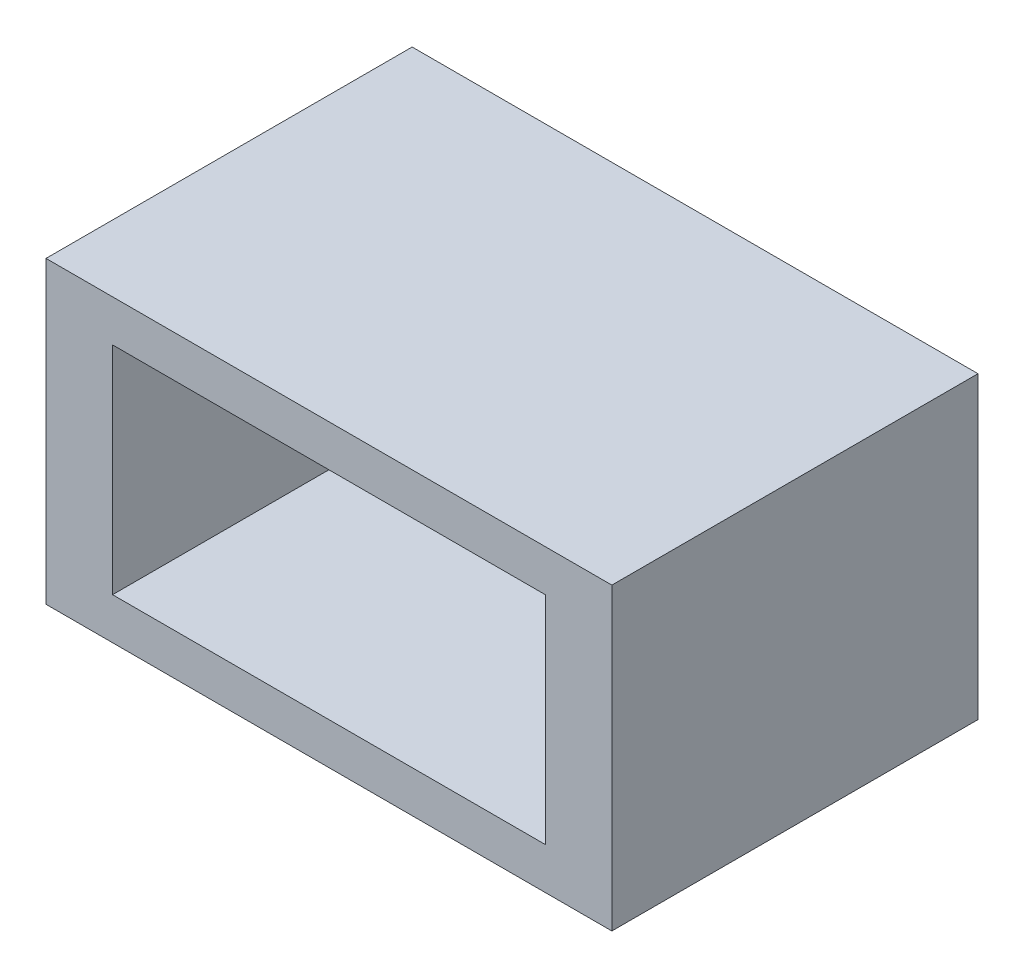
ISO-10303-21;
HEADER;
FILE_DESCRIPTION(('STEP AP214'),'2;1');
FILE_NAME('part.step','',(''),(''),'','','');
FILE_SCHEMA(('AUTOMOTIVE_DESIGN { 1 0 10303 214 1 1 1 1 }'));
ENDSEC;
DATA;
#1=APPLICATION_CONTEXT('core data for automotive mechanical design processes');
#2=APPLICATION_PROTOCOL_DEFINITION('international standard','automotive_design',2000,#1);
#3=PRODUCT_CONTEXT('',#1,'mechanical');
#4=PRODUCT('Part','Part','',(#3));
#5=PRODUCT_RELATED_PRODUCT_CATEGORY('part','',(#4));
#6=PRODUCT_DEFINITION_FORMATION('','',#4);
#7=PRODUCT_DEFINITION_CONTEXT('part definition',#1,'design');
#8=PRODUCT_DEFINITION('design','',#6,#7);
#9=PRODUCT_DEFINITION_SHAPE('','',#8);
#10=(LENGTH_UNIT() NAMED_UNIT(*) SI_UNIT(.MILLI.,.METRE.));
#11=(NAMED_UNIT(*) PLANE_ANGLE_UNIT() SI_UNIT($,.RADIAN.));
#12=(NAMED_UNIT(*) SI_UNIT($,.STERADIAN.) SOLID_ANGLE_UNIT());
#13=UNCERTAINTY_MEASURE_WITH_UNIT(LENGTH_MEASURE(1.E-05),#10,'distance_accuracy_value','');
#14=(GEOMETRIC_REPRESENTATION_CONTEXT(3) GLOBAL_UNCERTAINTY_ASSIGNED_CONTEXT((#13)) GLOBAL_UNIT_ASSIGNED_CONTEXT((#10,
#11,#12)) REPRESENTATION_CONTEXT('',''));
#15=CARTESIAN_POINT('',(0.,0.,0.));
#16=DIRECTION('',(0.,0.,1.));
#17=DIRECTION('',(1.,0.,0.));
#18=AXIS2_PLACEMENT_3D('',#15,#16,#17);
#19=CARTESIAN_POINT('',(8.5,4.5,11.));
#20=DIRECTION('',(-1.,0.,0.));
#21=DIRECTION('',(0.,-1.,0.));
#22=AXIS2_PLACEMENT_3D('',#19,#20,#21);
#23=PLANE('',#22);
#24=DIRECTION('',(0.,1.,0.));
#25=VECTOR('',#24,1.);
#26=CARTESIAN_POINT('',(8.5,4.5,0.));
#27=LINE('',#26,#25);
#28=CARTESIAN_POINT('',(8.50000000000001,-4.5,0.));
#29=VERTEX_POINT('',#28);
#30=CARTESIAN_POINT('',(8.5,4.5,0.));
#31=VERTEX_POINT('',#30);
#32=EDGE_CURVE('E127',#29,#31,#27,.T.);
#33=ORIENTED_EDGE('',*,*,#32,.T.);
#34=DIRECTION('',(0.,0.,-1.));
#35=VECTOR('',#34,1.);
#36=CARTESIAN_POINT('',(8.5,4.5,11.));
#37=LINE('',#36,#35);
#38=CARTESIAN_POINT('',(8.5,4.5,11.));
#39=VERTEX_POINT('',#38);
#40=EDGE_CURVE('E11',#39,#31,#37,.T.);
#41=ORIENTED_EDGE('',*,*,#40,.F.);
#42=DIRECTION('',(0.,1.,0.));
#43=VECTOR('',#42,1.);
#44=CARTESIAN_POINT('',(8.5,4.5,11.));
#45=LINE('',#44,#43);
#46=CARTESIAN_POINT('',(8.50000000000001,-4.5,11.));
#47=VERTEX_POINT('',#46);
#48=EDGE_CURVE('E129',#47,#39,#45,.T.);
#49=ORIENTED_EDGE('',*,*,#48,.F.);
#50=DIRECTION('',(0.,0.,-1.));
#51=VECTOR('',#50,1.);
#52=CARTESIAN_POINT('',(8.50000000000001,-4.5,11.));
#53=LINE('',#52,#51);
#54=EDGE_CURVE('E139',#47,#29,#53,.T.);
#55=ORIENTED_EDGE('',*,*,#54,.T.);
#56=EDGE_LOOP('',(#33,#41,#49,#55));
#57=FACE_BOUND('',#56,.T.);
#58=ADVANCED_FACE('F33',(#57),#23,.F.);
#59=CARTESIAN_POINT('',(-8.5,4.5,11.));
#60=DIRECTION('',(0.,-1.,0.));
#61=DIRECTION('',(0.,0.,-1.));
#62=AXIS2_PLACEMENT_3D('',#59,#60,#61);
#63=PLANE('',#62);
#64=DIRECTION('',(-1.,0.,0.));
#65=VECTOR('',#64,1.);
#66=CARTESIAN_POINT('',(-8.5,4.5,0.));
#67=LINE('',#66,#65);
#68=CARTESIAN_POINT('',(-8.5,4.5,0.));
#69=VERTEX_POINT('',#68);
#70=EDGE_CURVE('E142',#31,#69,#67,.T.);
#71=ORIENTED_EDGE('',*,*,#70,.T.);
#72=DIRECTION('',(0.,0.,-1.));
#73=VECTOR('',#72,1.);
#74=CARTESIAN_POINT('',(-8.5,4.5,11.));
#75=LINE('',#74,#73);
#76=CARTESIAN_POINT('',(-8.5,4.5,11.));
#77=VERTEX_POINT('',#76);
#78=EDGE_CURVE('E40',#77,#69,#75,.T.);
#79=ORIENTED_EDGE('',*,*,#78,.F.);
#80=DIRECTION('',(-1.,0.,0.));
#81=VECTOR('',#80,1.);
#82=CARTESIAN_POINT('',(-8.5,4.5,11.));
#83=LINE('',#82,#81);
#84=EDGE_CURVE('E132',#39,#77,#83,.T.);
#85=ORIENTED_EDGE('',*,*,#84,.F.);
#86=ORIENTED_EDGE('',*,*,#40,.T.);
#87=EDGE_LOOP('',(#71,#79,#85,#86));
#88=FACE_BOUND('',#87,.T.);
#89=ADVANCED_FACE('F170',(#88),#63,.F.);
#90=CARTESIAN_POINT('',(-8.5,4.5,11.));
#91=DIRECTION('',(1.,0.,0.));
#92=DIRECTION('',(0.,1.,0.));
#93=AXIS2_PLACEMENT_3D('',#90,#91,#92);
#94=PLANE('',#93);
#95=DIRECTION('',(0.,-1.,0.));
#96=VECTOR('',#95,1.);
#97=CARTESIAN_POINT('',(-8.5,4.5,0.));
#98=LINE('',#97,#96);
#99=CARTESIAN_POINT('',(-8.49999999999999,-4.5,0.));
#100=VERTEX_POINT('',#99);
#101=EDGE_CURVE('E144',#69,#100,#98,.T.);
#102=ORIENTED_EDGE('',*,*,#101,.T.);
#103=DIRECTION('',(0.,0.,-1.));
#104=VECTOR('',#103,1.);
#105=CARTESIAN_POINT('',(-8.49999999999999,-4.5,11.));
#106=LINE('',#105,#104);
#107=CARTESIAN_POINT('',(-8.49999999999999,-4.5,11.));
#108=VERTEX_POINT('',#107);
#109=EDGE_CURVE('E149',#108,#100,#106,.T.);
#110=ORIENTED_EDGE('',*,*,#109,.F.);
#111=DIRECTION('',(0.,-1.,0.));
#112=VECTOR('',#111,1.);
#113=CARTESIAN_POINT('',(-8.5,4.5,11.));
#114=LINE('',#113,#112);
#115=EDGE_CURVE('E135',#77,#108,#114,.T.);
#116=ORIENTED_EDGE('',*,*,#115,.F.);
#117=ORIENTED_EDGE('',*,*,#78,.T.);
#118=EDGE_LOOP('',(#102,#110,#116,#117));
#119=FACE_BOUND('',#118,.T.);
#120=ADVANCED_FACE('F156',(#119),#94,.F.);
#121=CARTESIAN_POINT('',(-8.49999999999999,-4.5,11.));
#122=DIRECTION('',(0.,1.,0.));
#123=DIRECTION('',(0.,0.,1.));
#124=AXIS2_PLACEMENT_3D('',#121,#122,#123);
#125=PLANE('',#124);
#126=DIRECTION('',(1.,0.,0.));
#127=VECTOR('',#126,1.);
#128=CARTESIAN_POINT('',(-8.49999999999999,-4.5,0.));
#129=LINE('',#128,#127);
#130=EDGE_CURVE('E133',#100,#29,#129,.T.);
#131=ORIENTED_EDGE('',*,*,#130,.T.);
#132=ORIENTED_EDGE('',*,*,#54,.F.);
#133=DIRECTION('',(1.,0.,0.));
#134=VECTOR('',#133,1.);
#135=CARTESIAN_POINT('',(-8.49999999999999,-4.5,11.));
#136=LINE('',#135,#134);
#137=EDGE_CURVE('E137',#108,#47,#136,.T.);
#138=ORIENTED_EDGE('',*,*,#137,.F.);
#139=ORIENTED_EDGE('',*,*,#109,.T.);
#140=EDGE_LOOP('',(#131,#132,#138,#139));
#141=FACE_BOUND('',#140,.T.);
#142=ADVANCED_FACE('F165',(#141),#125,.F.);
#143=CARTESIAN_POINT('',(0.,0.,11.));
#144=DIRECTION('',(0.,0.,1.));
#145=DIRECTION('',(1.,0.,0.));
#146=AXIS2_PLACEMENT_3D('',#143,#144,#145);
#147=PLANE('',#146);
#148=DIRECTION('',(0.,-1.,0.));
#149=VECTOR('',#148,1.);
#150=CARTESIAN_POINT('',(-6.5,3.25,11.));
#151=LINE('',#150,#149);
#152=CARTESIAN_POINT('',(-6.5,3.25,11.));
#153=VERTEX_POINT('',#152);
#154=CARTESIAN_POINT('',(-6.5,-3.25,11.));
#155=VERTEX_POINT('',#154);
#156=EDGE_CURVE('E47',#153,#155,#151,.T.);
#157=ORIENTED_EDGE('',*,*,#156,.F.);
#158=DIRECTION('',(1.,0.,0.));
#159=VECTOR('',#158,1.);
#160=CARTESIAN_POINT('',(-6.5,3.25,11.));
#161=LINE('',#160,#159);
#162=CARTESIAN_POINT('',(6.5,3.25,11.));
#163=VERTEX_POINT('',#162);
#164=EDGE_CURVE('E116',#153,#163,#161,.T.);
#165=ORIENTED_EDGE('',*,*,#164,.T.);
#166=DIRECTION('',(0.,-1.,0.));
#167=VECTOR('',#166,1.);
#168=CARTESIAN_POINT('',(6.5,3.25,11.));
#169=LINE('',#168,#167);
#170=CARTESIAN_POINT('',(6.5,-3.25,11.));
#171=VERTEX_POINT('',#170);
#172=EDGE_CURVE('E100',#163,#171,#169,.T.);
#173=ORIENTED_EDGE('',*,*,#172,.T.);
#174=DIRECTION('',(1.,0.,0.));
#175=VECTOR('',#174,1.);
#176=CARTESIAN_POINT('',(-6.5,-3.25,11.));
#177=LINE('',#176,#175);
#178=EDGE_CURVE('E109',#155,#171,#177,.T.);
#179=ORIENTED_EDGE('',*,*,#178,.F.);
#180=EDGE_LOOP('',(#157,#165,#173,#179));
#181=FACE_BOUND('',#180,.T.);
#182=ORIENTED_EDGE('',*,*,#48,.T.);
#183=ORIENTED_EDGE('',*,*,#84,.T.);
#184=ORIENTED_EDGE('',*,*,#115,.T.);
#185=ORIENTED_EDGE('',*,*,#137,.T.);
#186=EDGE_LOOP('',(#182,#183,#184,#185));
#187=FACE_BOUND('',#186,.T.);
#188=ADVANCED_FACE('F113',(#181,#187),#147,.T.);
#189=CARTESIAN_POINT('',(0.,0.,0.));
#190=DIRECTION('',(0.,0.,1.));
#191=DIRECTION('',(1.,0.,0.));
#192=AXIS2_PLACEMENT_3D('',#189,#190,#191);
#193=PLANE('',#192);
#194=DIRECTION('',(-1.,0.,0.));
#195=VECTOR('',#194,1.);
#196=CARTESIAN_POINT('',(-6.5,3.25,0.));
#197=LINE('',#196,#195);
#198=CARTESIAN_POINT('',(6.5,3.25,0.));
#199=VERTEX_POINT('',#198);
#200=CARTESIAN_POINT('',(-6.5,3.25,0.));
#201=VERTEX_POINT('',#200);
#202=EDGE_CURVE('E199',#199,#201,#197,.T.);
#203=ORIENTED_EDGE('',*,*,#202,.T.);
#204=DIRECTION('',(0.,1.,0.));
#205=VECTOR('',#204,1.);
#206=CARTESIAN_POINT('',(-6.5,3.25,0.));
#207=LINE('',#206,#205);
#208=CARTESIAN_POINT('',(-6.5,-3.25,0.));
#209=VERTEX_POINT('',#208);
#210=EDGE_CURVE('E128',#209,#201,#207,.T.);
#211=ORIENTED_EDGE('',*,*,#210,.F.);
#212=DIRECTION('',(-1.,0.,0.));
#213=VECTOR('',#212,1.);
#214=CARTESIAN_POINT('',(-6.5,-3.25,0.));
#215=LINE('',#214,#213);
#216=CARTESIAN_POINT('',(6.5,-3.25,0.));
#217=VERTEX_POINT('',#216);
#218=EDGE_CURVE('E125',#217,#209,#215,.T.);
#219=ORIENTED_EDGE('',*,*,#218,.F.);
#220=DIRECTION('',(0.,1.,0.));
#221=VECTOR('',#220,1.);
#222=CARTESIAN_POINT('',(6.5,3.25,0.));
#223=LINE('',#222,#221);
#224=EDGE_CURVE('E103',#217,#199,#223,.T.);
#225=ORIENTED_EDGE('',*,*,#224,.T.);
#226=EDGE_LOOP('',(#203,#211,#219,#225));
#227=FACE_BOUND('',#226,.T.);
#228=ORIENTED_EDGE('',*,*,#32,.F.);
#229=ORIENTED_EDGE('',*,*,#130,.F.);
#230=ORIENTED_EDGE('',*,*,#101,.F.);
#231=ORIENTED_EDGE('',*,*,#70,.F.);
#232=EDGE_LOOP('',(#228,#229,#230,#231));
#233=FACE_BOUND('',#232,.T.);
#234=ADVANCED_FACE('F162',(#227,#233),#193,.F.);
#235=CARTESIAN_POINT('',(-6.5,3.25,-14.5344418537486));
#236=DIRECTION('',(-1.,0.,0.));
#237=DIRECTION('',(0.,-1.,0.));
#238=AXIS2_PLACEMENT_3D('',#235,#236,#237);
#239=PLANE('',#238);
#240=ORIENTED_EDGE('',*,*,#210,.T.);
#241=DIRECTION('',(0.,0.,1.));
#242=VECTOR('',#241,1.);
#243=CARTESIAN_POINT('',(-6.5,3.25,-14.5344418537486));
#244=LINE('',#243,#242);
#245=EDGE_CURVE('E121',#201,#153,#244,.T.);
#246=ORIENTED_EDGE('',*,*,#245,.T.);
#247=ORIENTED_EDGE('',*,*,#156,.T.);
#248=DIRECTION('',(0.,0.,1.));
#249=VECTOR('',#248,1.);
#250=CARTESIAN_POINT('',(-6.5,-3.25,-14.5344418537486));
#251=LINE('',#250,#249);
#252=EDGE_CURVE('E106',#209,#155,#251,.T.);
#253=ORIENTED_EDGE('',*,*,#252,.F.);
#254=EDGE_LOOP('',(#240,#246,#247,#253));
#255=FACE_BOUND('',#254,.T.);
#256=ADVANCED_FACE('F182',(#255),#239,.F.);
#257=CARTESIAN_POINT('',(-6.5,3.25,-14.5344418537486));
#258=DIRECTION('',(0.,-1.,0.));
#259=DIRECTION('',(0.,0.,-1.));
#260=AXIS2_PLACEMENT_3D('',#257,#258,#259);
#261=PLANE('',#260);
#262=DIRECTION('',(0.,0.,1.));
#263=VECTOR('',#262,1.);
#264=CARTESIAN_POINT('',(6.5,3.25,-14.5344418537486));
#265=LINE('',#264,#263);
#266=EDGE_CURVE('E105',#199,#163,#265,.T.);
#267=ORIENTED_EDGE('',*,*,#266,.T.);
#268=ORIENTED_EDGE('',*,*,#164,.F.);
#269=ORIENTED_EDGE('',*,*,#245,.F.);
#270=ORIENTED_EDGE('',*,*,#202,.F.);
#271=EDGE_LOOP('',(#267,#268,#269,#270));
#272=FACE_BOUND('',#271,.T.);
#273=ADVANCED_FACE('F188',(#272),#261,.T.);
#274=CARTESIAN_POINT('',(6.5,3.25,-14.5344418537486));
#275=DIRECTION('',(-1.,0.,0.));
#276=DIRECTION('',(0.,-1.,0.));
#277=AXIS2_PLACEMENT_3D('',#274,#275,#276);
#278=PLANE('',#277);
#279=DIRECTION('',(0.,0.,1.));
#280=VECTOR('',#279,1.);
#281=CARTESIAN_POINT('',(6.5,-3.25,-14.5344418537486));
#282=LINE('',#281,#280);
#283=EDGE_CURVE('E55',#217,#171,#282,.T.);
#284=ORIENTED_EDGE('',*,*,#283,.T.);
#285=ORIENTED_EDGE('',*,*,#172,.F.);
#286=ORIENTED_EDGE('',*,*,#266,.F.);
#287=ORIENTED_EDGE('',*,*,#224,.F.);
#288=EDGE_LOOP('',(#284,#285,#286,#287));
#289=FACE_BOUND('',#288,.T.);
#290=ADVANCED_FACE('F97',(#289),#278,.T.);
#291=CARTESIAN_POINT('',(-6.5,-3.25,-14.5344418537486));
#292=DIRECTION('',(0.,-1.,0.));
#293=DIRECTION('',(0.,0.,-1.));
#294=AXIS2_PLACEMENT_3D('',#291,#292,#293);
#295=PLANE('',#294);
#296=ORIENTED_EDGE('',*,*,#218,.T.);
#297=ORIENTED_EDGE('',*,*,#252,.T.);
#298=ORIENTED_EDGE('',*,*,#178,.T.);
#299=ORIENTED_EDGE('',*,*,#283,.F.);
#300=EDGE_LOOP('',(#296,#297,#298,#299));
#301=FACE_BOUND('',#300,.T.);
#302=ADVANCED_FACE('F110',(#301),#295,.F.);
#303=CLOSED_SHELL('',(#58,#89,#120,#142,#188,#234,#256,#273,#290,#302));
#304=MANIFOLD_SOLID_BREP('B2',#303);
#305=ADVANCED_BREP_SHAPE_REPRESENTATION('',(#18,#304),#14);
#306=SHAPE_DEFINITION_REPRESENTATION(#9,#305);
ENDSEC;
END-ISO-10303-21;
